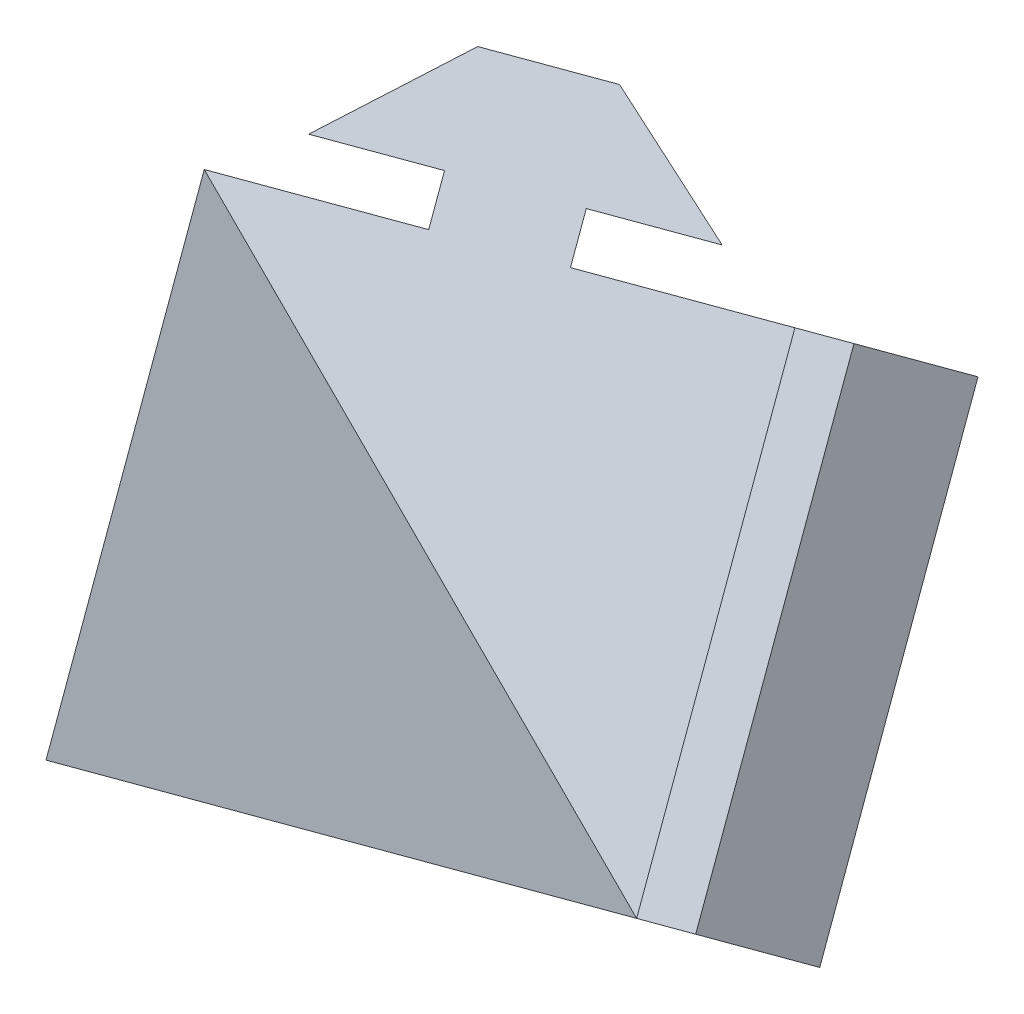
ISO-10303-21;
HEADER;
FILE_DESCRIPTION(('STEP AP214'),'2;1');
FILE_NAME('part.step','',(''),(''),'','','');
FILE_SCHEMA(('AUTOMOTIVE_DESIGN { 1 0 10303 214 1 1 1 1 }'));
ENDSEC;
DATA;
#1=APPLICATION_CONTEXT('core data for automotive mechanical design processes');
#2=APPLICATION_PROTOCOL_DEFINITION('international standard','automotive_design',2000,#1);
#3=PRODUCT_CONTEXT('',#1,'mechanical');
#4=PRODUCT('Part','Part','',(#3));
#5=PRODUCT_RELATED_PRODUCT_CATEGORY('part','',(#4));
#6=PRODUCT_DEFINITION_FORMATION('','',#4);
#7=PRODUCT_DEFINITION_CONTEXT('part definition',#1,'design');
#8=PRODUCT_DEFINITION('design','',#6,#7);
#9=PRODUCT_DEFINITION_SHAPE('','',#8);
#10=(LENGTH_UNIT() NAMED_UNIT(*) SI_UNIT(.MILLI.,.METRE.));
#11=(NAMED_UNIT(*) PLANE_ANGLE_UNIT() SI_UNIT($,.RADIAN.));
#12=(NAMED_UNIT(*) SI_UNIT($,.STERADIAN.) SOLID_ANGLE_UNIT());
#13=UNCERTAINTY_MEASURE_WITH_UNIT(LENGTH_MEASURE(1.E-05),#10,'distance_accuracy_value','');
#14=(GEOMETRIC_REPRESENTATION_CONTEXT(3) GLOBAL_UNCERTAINTY_ASSIGNED_CONTEXT((#13)) GLOBAL_UNIT_ASSIGNED_CONTEXT((#10,
#11,#12)) REPRESENTATION_CONTEXT('',''));
#15=CARTESIAN_POINT('',(0.,0.,0.));
#16=DIRECTION('',(0.,0.,1.));
#17=DIRECTION('',(1.,0.,0.));
#18=AXIS2_PLACEMENT_3D('',#15,#16,#17);
#19=CARTESIAN_POINT('',(-73.0037702005573,-51.8749967036636,0.));
#20=DIRECTION('',(0.211324865405187,-0.788675134594813,0.577350269189626));
#21=DIRECTION('',(0.577350269189626,0.577350269189626,0.577350269189626));
#22=AXIS2_PLACEMENT_3D('',#19,#20,#21);
#23=PLANE('',#22);
#24=DIRECTION('',(-0.577350269189626,-0.577350269189626,-0.577350269189626));
#25=VECTOR('',#24,1.);
#26=CARTESIAN_POINT('',(-73.0037702005573,-51.8749967036636,0.));
#27=LINE('',#26,#25);
#28=CARTESIAN_POINT('',(-73.0037702005573,-51.8749967036636,0.));
#29=VERTEX_POINT('',#28);
#30=CARTESIAN_POINT('',(-77.3916322463984,-56.2628587495048,-4.38786204584115));
#31=VERTEX_POINT('',#30);
#32=EDGE_CURVE('E235',#29,#31,#27,.T.);
#33=ORIENTED_EDGE('',*,*,#32,.F.);
#34=DIRECTION('',(-0.965925826289068,-0.258819045102521,0.));
#35=VECTOR('',#34,1.);
#36=CARTESIAN_POINT('',(-73.0037702005573,-51.8749967036636,0.));
#37=LINE('',#36,#35);
#38=CARTESIAN_POINT('',(-100.324278276246,-59.1955047793524,0.));
#39=VERTEX_POINT('',#38);
#40=EDGE_CURVE('E202',#29,#39,#37,.T.);
#41=ORIENTED_EDGE('',*,*,#40,.T.);
#42=DIRECTION('',(0.788675134594813,-0.211324865405187,-0.577350269189626));
#43=VECTOR('',#42,1.);
#44=CARTESIAN_POINT('',(-84.5507755843498,-63.4220020874561,-11.5470053837925));
#45=LINE('',#44,#43);
#46=CARTESIAN_POINT('',(-84.5507755843498,-63.4220020874561,-11.5470053837925));
#47=VERTEX_POINT('',#46);
#48=EDGE_CURVE('E277',#39,#47,#45,.T.);
#49=ORIENTED_EDGE('',*,*,#48,.T.);
#50=CARTESIAN_POINT('',(-80.1629135385086,-59.0341400416149,-7.15914333795129));
#51=VERTEX_POINT('',#50);
#52=EDGE_CURVE('E231',#51,#47,#27,.T.);
#53=ORIENTED_EDGE('',*,*,#52,.F.);
#54=DIRECTION('',(0.788675134594815,-0.21132486540518,-0.577350269189626));
#55=VECTOR('',#54,1.);
#56=CARTESIAN_POINT('',(-78.5855632693189,-59.4567897724253,-8.31384387633061));
#57=LINE('',#56,#55);
#58=CARTESIAN_POINT('',(-78.5855632693189,-59.4567897724253,-8.31384387633061));
#59=VERTEX_POINT('',#58);
#60=EDGE_CURVE('E38',#51,#59,#57,.T.);
#61=ORIENTED_EDGE('',*,*,#60,.T.);
#62=DIRECTION('',(-0.57735026918962,-0.577350269189631,-0.577350269189626));
#63=VECTOR('',#62,1.);
#64=CARTESIAN_POINT('',(-81.2413745075912,-62.1126010106976,-10.9696551146029));
#65=LINE('',#64,#63);
#66=CARTESIAN_POINT('',(-81.2413745075912,-62.1126010106976,-10.9696551146029));
#67=VERTEX_POINT('',#66);
#68=EDGE_CURVE('E332',#59,#67,#65,.T.);
#69=ORIENTED_EDGE('',*,*,#68,.T.);
#70=DIRECTION('',(0.958144280134718,0.283874916113397,0.0370751998880033));
#71=VECTOR('',#70,1.);
#72=CARTESIAN_POINT('',(-75.2731277040207,-60.344354207127,-10.738715006927));
#73=LINE('',#72,#71);
#74=CARTESIAN_POINT('',(-75.2731277040207,-60.344354207127,-10.738715006927));
#75=VERTEX_POINT('',#74);
#76=EDGE_CURVE('E468',#67,#75,#73,.T.);
#77=ORIENTED_EDGE('',*,*,#76,.T.);
#78=DIRECTION('',(0.57735026918962,0.577350269189631,0.577350269189626));
#79=VECTOR('',#78,1.);
#80=CARTESIAN_POINT('',(-72.5018464119105,-57.5730729150168,-7.96743371481683));
#81=LINE('',#80,#79);
#82=CARTESIAN_POINT('',(-72.5018464119105,-57.5730729150168,-7.96743371481683));
#83=VERTEX_POINT('',#82);
#84=EDGE_CURVE('E471',#75,#83,#81,.T.);
#85=ORIENTED_EDGE('',*,*,#84,.T.);
#86=DIRECTION('',(-0.105414682710652,0.568854681310686,0.815654397536071));
#87=VECTOR('',#86,1.);
#88=CARTESIAN_POINT('',(-72.5018464119105,-57.5730729150168,-7.96743371481683));
#89=LINE('',#88,#87);
#90=CARTESIAN_POINT('',(-73.1584707389365,-54.0296972420427,-2.88675134594813));
#91=VERTEX_POINT('',#90);
#92=EDGE_CURVE('E475',#83,#91,#89,.T.);
#93=ORIENTED_EDGE('',*,*,#92,.T.);
#94=DIRECTION('',(-0.57735026918962,-0.577350269189631,-0.577350269189626));
#95=VECTOR('',#94,1.);
#96=CARTESIAN_POINT('',(-73.1584707389365,-54.0296972420427,-2.88675134594813));
#97=LINE('',#96,#95);
#98=CARTESIAN_POINT('',(-75.8142819772087,-56.685508480315,-5.54256258422041));
#99=VERTEX_POINT('',#98);
#100=EDGE_CURVE('E478',#91,#99,#97,.T.);
#101=ORIENTED_EDGE('',*,*,#100,.T.);
#102=DIRECTION('',(-0.788675134594815,0.21132486540518,0.577350269189626));
#103=VECTOR('',#102,1.);
#104=CARTESIAN_POINT('',(-75.8142819772087,-56.685508480315,-5.54256258422041));
#105=LINE('',#104,#103);
#106=EDGE_CURVE('E315',#99,#31,#105,.T.);
#107=ORIENTED_EDGE('',*,*,#106,.T.);
#108=EDGE_LOOP('',(#33,#41,#49,#53,#61,#69,#77,#85,#93,#101,#107));
#109=FACE_BOUND('',#108,.T.);
#110=ADVANCED_FACE('F15',(#109),#23,.T.);
#111=CARTESIAN_POINT('',(-93.0037702005573,-31.8749967036636,0.));
#112=DIRECTION('',(-0.788675134594813,0.211324865405187,0.577350269189626));
#113=DIRECTION('',(0.211324865405187,-0.788675134594813,0.577350269189626));
#114=AXIS2_PLACEMENT_3D('',#111,#112,#113);
#115=PLANE('',#114);
#116=DIRECTION('',(0.211324865405187,-0.788675134594813,0.577350269189626));
#117=VECTOR('',#116,1.);
#118=CARTESIAN_POINT('',(-104.55077558435,-43.4220020874561,-11.5470053837925));
#119=LINE('',#118,#117);
#120=CARTESIAN_POINT('',(-101.930347253325,-53.2015737564319,-4.38786204584116));
#121=VERTEX_POINT('',#120);
#122=EDGE_CURVE('E215',#121,#39,#119,.T.);
#123=ORIENTED_EDGE('',*,*,#122,.T.);
#124=DIRECTION('',(0.258819045102521,0.965925826289068,0.));
#125=VECTOR('',#124,1.);
#126=CARTESIAN_POINT('',(-93.0037702005573,-31.8749967036636,0.));
#127=LINE('',#126,#125);
#128=CARTESIAN_POINT('',(-93.0037702005573,-31.8749967036636,0.));
#129=VERTEX_POINT('',#128);
#130=EDGE_CURVE('E200',#39,#129,#127,.T.);
#131=ORIENTED_EDGE('',*,*,#130,.T.);
#132=DIRECTION('',(-0.577350269189626,-0.577350269189626,-0.577350269189626));
#133=VECTOR('',#132,1.);
#134=CARTESIAN_POINT('',(-93.0037702005573,-31.8749967036636,0.));
#135=LINE('',#134,#133);
#136=CARTESIAN_POINT('',(-104.55077558435,-43.4220020874561,-11.5470053837925));
#137=VERTEX_POINT('',#136);
#138=EDGE_CURVE('E211',#129,#137,#135,.T.);
#139=ORIENTED_EDGE('',*,*,#138,.T.);
#140=CARTESIAN_POINT('',(-102.94470660727,-49.4159331103768,-7.15914333795133));
#141=VERTEX_POINT('',#140);
#142=EDGE_CURVE('E275',#137,#141,#119,.T.);
#143=ORIENTED_EDGE('',*,*,#142,.T.);
#144=DIRECTION('',(-0.577350269189623,-0.577350269189629,-0.577350269189626));
#145=VECTOR('',#144,1.);
#146=CARTESIAN_POINT('',(-104.09940714565,-50.570633648756,-8.31384387633061));
#147=LINE('',#146,#145);
#148=CARTESIAN_POINT('',(-104.09940714565,-50.570633648756,-8.31384387633061));
#149=VERTEX_POINT('',#148);
#150=EDGE_CURVE('E348',#141,#149,#147,.T.);
#151=ORIENTED_EDGE('',*,*,#150,.T.);
#152=DIRECTION('',(-0.211324865405191,0.788675134594812,-0.577350269189626));
#153=VECTOR('',#152,1.);
#154=CARTESIAN_POINT('',(-105.071501526514,-46.9427280296199,-10.9696551146029));
#155=LINE('',#154,#153);
#156=CARTESIAN_POINT('',(-105.071501526514,-46.9427280296199,-10.9696551146029));
#157=VERTEX_POINT('',#156);
#158=EDGE_CURVE('E351',#149,#157,#155,.T.);
#159=ORIENTED_EDGE('',*,*,#158,.T.);
#160=DIRECTION('',(-0.233229251215985,-0.971714745144117,0.0370751998880033));
#161=VECTOR('',#160,1.);
#162=CARTESIAN_POINT('',(-106.524278276246,-52.9955047793525,-10.738715006927));
#163=LINE('',#162,#161);
#164=CARTESIAN_POINT('',(-106.524278276246,-52.9955047793525,-10.738715006927));
#165=VERTEX_POINT('',#164);
#166=EDGE_CURVE('E333',#157,#165,#163,.T.);
#167=ORIENTED_EDGE('',*,*,#166,.T.);
#168=DIRECTION('',(0.211324865405191,-0.788675134594812,0.577350269189626));
#169=VECTOR('',#168,1.);
#170=CARTESIAN_POINT('',(-105.509918922301,-56.7811454254076,-7.96743371481684));
#171=LINE('',#170,#169);
#172=CARTESIAN_POINT('',(-105.509918922301,-56.7811454254076,-7.96743371481684));
#173=VERTEX_POINT('',#172);
#174=EDGE_CURVE('E336',#165,#173,#171,.T.);
#175=ORIENTED_EDGE('',*,*,#174,.T.);
#176=DIRECTION('',(0.545349946432079,-0.193135547496045,0.815654397536071));
#177=VECTOR('',#176,1.);
#178=CARTESIAN_POINT('',(-105.509918922301,-56.7811454254076,-7.96743371481684));
#179=LINE('',#178,#177);
#180=CARTESIAN_POINT('',(-102.112953410841,-57.9841799139473,-2.88675134594813));
#181=VERTEX_POINT('',#180);
#182=EDGE_CURVE('E340',#173,#181,#179,.T.);
#183=ORIENTED_EDGE('',*,*,#182,.T.);
#184=DIRECTION('',(-0.211324865405191,0.788675134594812,-0.577350269189626));
#185=VECTOR('',#184,1.);
#186=CARTESIAN_POINT('',(-102.112953410841,-57.9841799139473,-2.88675134594813));
#187=LINE('',#186,#185);
#188=CARTESIAN_POINT('',(-103.085047791705,-54.3562742948111,-5.54256258422041));
#189=VERTEX_POINT('',#188);
#190=EDGE_CURVE('E343',#181,#189,#187,.T.);
#191=ORIENTED_EDGE('',*,*,#190,.T.);
#192=DIRECTION('',(0.577350269189623,0.577350269189629,0.577350269189626));
#193=VECTOR('',#192,1.);
#194=CARTESIAN_POINT('',(-103.085047791705,-54.3562742948111,-5.54256258422041));
#195=LINE('',#194,#193);
#196=EDGE_CURVE('E346',#189,#121,#195,.T.);
#197=ORIENTED_EDGE('',*,*,#196,.T.);
#198=EDGE_LOOP('',(#123,#131,#139,#143,#151,#159,#167,#175,#183,#191,#197));
#199=FACE_BOUND('',#198,.T.);
#200=ADVANCED_FACE('F208',(#199),#115,.T.);
#201=CARTESIAN_POINT('',(-88.7772728924536,-47.6484993955599,11.5470053837925));
#202=DIRECTION('',(0.577350269189626,0.577350269189626,0.577350269189626));
#203=DIRECTION('',(-0.788675134594813,0.211324865405187,0.577350269189626));
#204=AXIS2_PLACEMENT_3D('',#201,#202,#203);
#205=PLANE('',#204);
#206=DIRECTION('',(-0.788675134594813,0.211324865405187,0.577350269189626));
#207=VECTOR('',#206,1.);
#208=CARTESIAN_POINT('',(-87.0098391776367,-33.481065680743,-4.38786204584116));
#209=LINE('',#208,#207);
#210=CARTESIAN_POINT('',(-87.0098391776367,-33.481065680743,-4.38786204584116));
#211=VERTEX_POINT('',#210);
#212=EDGE_CURVE('E219',#211,#129,#209,.T.);
#213=ORIENTED_EDGE('',*,*,#212,.T.);
#214=DIRECTION('',(0.707106781186548,-0.707106781186547,0.));
#215=VECTOR('',#214,1.);
#216=CARTESIAN_POINT('',(-83.0037702005573,-41.8749967036636,0.));
#217=LINE('',#216,#215);
#218=EDGE_CURVE('E10',#129,#29,#217,.T.);
#219=ORIENTED_EDGE('',*,*,#218,.T.);
#220=DIRECTION('',(-0.211324865405187,0.788675134594813,-0.577350269189626));
#221=VECTOR('',#220,1.);
#222=CARTESIAN_POINT('',(-77.230267508661,-36.1014940117674,-11.5470053837925));
#223=LINE('',#222,#221);
#224=CARTESIAN_POINT('',(-77.230267508661,-36.1014940117674,-11.5470053837925));
#225=VERTEX_POINT('',#224);
#226=EDGE_CURVE('E225',#29,#225,#223,.T.);
#227=ORIENTED_EDGE('',*,*,#226,.T.);
#228=DIRECTION('',(-0.788675134594813,0.211324865405187,0.577350269189626));
#229=VECTOR('',#228,1.);
#230=CARTESIAN_POINT('',(-83.2241985315816,-34.4954250346879,-7.15914333795136));
#231=LINE('',#230,#229);
#232=CARTESIAN_POINT('',(-83.2241985315816,-34.4954250346879,-7.15914333795136));
#233=VERTEX_POINT('',#232);
#234=EDGE_CURVE('E256',#225,#233,#231,.T.);
#235=ORIENTED_EDGE('',*,*,#234,.T.);
#236=DIRECTION('',(-0.211324865405187,0.788675134594813,-0.577350269189626));
#237=VECTOR('',#236,1.);
#238=CARTESIAN_POINT('',(-83.646848262392,-32.9180747654983,-8.31384387633061));
#239=LINE('',#238,#237);
#240=CARTESIAN_POINT('',(-83.646848262392,-32.9180747654983,-8.31384387633061));
#241=VERTEX_POINT('',#240);
#242=EDGE_CURVE('E251',#233,#241,#239,.T.);
#243=ORIENTED_EDGE('',*,*,#242,.T.);
#244=DIRECTION('',(0.788675134594813,-0.211324865405187,-0.577350269189626));
#245=VECTOR('',#244,1.);
#246=CARTESIAN_POINT('',(-80.0189426432558,-33.8901691463622,-10.9696551146029));
#247=LINE('',#246,#245);
#248=CARTESIAN_POINT('',(-80.0189426432558,-33.8901691463622,-10.9696551146029));
#249=VERTEX_POINT('',#248);
#250=EDGE_CURVE('E246',#241,#249,#247,.T.);
#251=ORIENTED_EDGE('',*,*,#250,.T.);
#252=DIRECTION('',(-0.724915028918731,0.687839829030727,0.0370751998880031));
#253=VECTOR('',#252,1.);
#254=CARTESIAN_POINT('',(-84.5344126970938,-29.6056392002001,-10.738715006927));
#255=LINE('',#254,#253);
#256=CARTESIAN_POINT('',(-84.5344126970938,-29.6056392002001,-10.738715006927));
#257=VERTEX_POINT('',#256);
#258=EDGE_CURVE('E292',#249,#257,#255,.T.);
#259=ORIENTED_EDGE('',*,*,#258,.T.);
#260=DIRECTION('',(-0.788675134594813,0.211324865405187,0.577350269189626));
#261=VECTOR('',#260,1.);
#262=CARTESIAN_POINT('',(-88.3200533431489,-28.5912798462552,-7.96743371481684));
#263=LINE('',#262,#261);
#264=CARTESIAN_POINT('',(-88.3200533431489,-28.5912798462552,-7.96743371481684));
#265=VERTEX_POINT('',#264);
#266=EDGE_CURVE('E391',#257,#265,#263,.T.);
#267=ORIENTED_EDGE('',*,*,#266,.T.);
#268=DIRECTION('',(-0.439935263721432,-0.375719133814639,0.815654397536071));
#269=VECTOR('',#268,1.);
#270=CARTESIAN_POINT('',(-88.3200533431489,-28.5912798462552,-7.96743371481684));
#271=LINE('',#270,#269);
#272=CARTESIAN_POINT('',(-91.0603945275832,-30.9316210306896,-2.88675134594813));
#273=VERTEX_POINT('',#272);
#274=EDGE_CURVE('E393',#265,#273,#271,.T.);
#275=ORIENTED_EDGE('',*,*,#274,.T.);
#276=DIRECTION('',(0.788675134594813,-0.211324865405187,-0.577350269189626));
#277=VECTOR('',#276,1.);
#278=CARTESIAN_POINT('',(-91.0603945275832,-30.9316210306896,-2.88675134594813));
#279=LINE('',#278,#277);
#280=CARTESIAN_POINT('',(-87.4324889084471,-31.9037154115534,-5.54256258422041));
#281=VERTEX_POINT('',#280);
#282=EDGE_CURVE('E395',#273,#281,#279,.T.);
#283=ORIENTED_EDGE('',*,*,#282,.T.);
#284=DIRECTION('',(0.211324865405187,-0.788675134594813,0.577350269189626));
#285=VECTOR('',#284,1.);
#286=CARTESIAN_POINT('',(-87.4324889084471,-31.9037154115534,-5.54256258422041));
#287=LINE('',#286,#285);
#288=EDGE_CURVE('E222',#281,#211,#287,.T.);
#289=ORIENTED_EDGE('',*,*,#288,.T.);
#290=EDGE_LOOP('',(#213,#219,#227,#235,#243,#251,#259,#267,#275,#283,#289));
#291=FACE_BOUND('',#290,.T.);
#292=ADVANCED_FACE('F220',(#291),#205,.T.);
#293=CARTESIAN_POINT('',(-77.230267508661,-36.1014940117674,-11.5470053837925));
#294=DIRECTION('',(0.788675134594813,-0.211324865405187,-0.577350269189626));
#295=DIRECTION('',(-0.211324865405187,0.788675134594813,-0.577350269189626));
#296=AXIS2_PLACEMENT_3D('',#293,#294,#295);
#297=PLANE('',#296);
#298=DIRECTION('',(-0.211324865405194,0.788675134594811,-0.577350269189626));
#299=VECTOR('',#298,1.);
#300=CARTESIAN_POINT('',(-80.1629135385085,-59.0341400416149,-7.15914333795136));
#301=LINE('',#300,#299);
#302=CARTESIAN_POINT('',(-84.3894108466124,-43.2606373497187,-18.7061487217438));
#303=VERTEX_POINT('',#302);
#304=EDGE_CURVE('E318',#51,#303,#301,.T.);
#305=ORIENTED_EDGE('',*,*,#304,.F.);
#306=ORIENTED_EDGE('',*,*,#52,.T.);
#307=DIRECTION('',(-0.211324865405187,0.788675134594813,-0.577350269189626));
#308=VECTOR('',#307,1.);
#309=CARTESIAN_POINT('',(-88.7772728924536,-47.6484993955599,-23.094010767585));
#310=LINE('',#309,#308);
#311=CARTESIAN_POINT('',(-86.1568445614292,-57.4280710645356,-15.9348674296337));
#312=VERTEX_POINT('',#311);
#313=EDGE_CURVE('E280',#47,#312,#310,.T.);
#314=ORIENTED_EDGE('',*,*,#313,.T.);
#315=DIRECTION('',(0.577350269189623,0.577350269189629,0.577350269189626));
#316=VECTOR('',#315,1.);
#317=CARTESIAN_POINT('',(-87.3115450998084,-58.5827716029148,-17.0895679680129));
#318=LINE('',#317,#316);
#319=CARTESIAN_POINT('',(-87.3115450998084,-58.5827716029148,-17.0895679680129));
#320=VERTEX_POINT('',#319);
#321=EDGE_CURVE('E368',#320,#312,#318,.T.);
#322=ORIENTED_EDGE('',*,*,#321,.F.);
#323=DIRECTION('',(-0.211324865405191,0.788675134594812,-0.577350269189626));
#324=VECTOR('',#323,1.);
#325=CARTESIAN_POINT('',(-86.3394507189445,-62.2106772220509,-14.4337567297406));
#326=LINE('',#325,#324);
#327=CARTESIAN_POINT('',(-86.3394507189445,-62.2106772220509,-14.4337567297406));
#328=VERTEX_POINT('',#327);
#329=EDGE_CURVE('E365',#328,#320,#326,.T.);
#330=ORIENTED_EDGE('',*,*,#329,.F.);
#331=DIRECTION('',(0.545349946432079,-0.193135547496045,0.815654397536071));
#332=VECTOR('',#331,1.);
#333=CARTESIAN_POINT('',(-89.7364162304048,-61.0076427335112,-19.5144390986094));
#334=LINE('',#333,#332);
#335=CARTESIAN_POINT('',(-89.7364162304048,-61.0076427335112,-19.5144390986094));
#336=VERTEX_POINT('',#335);
#337=EDGE_CURVE('E362',#336,#328,#334,.T.);
#338=ORIENTED_EDGE('',*,*,#337,.F.);
#339=DIRECTION('',(0.211324865405191,-0.788675134594812,0.577350269189626));
#340=VECTOR('',#339,1.);
#341=CARTESIAN_POINT('',(-89.7364162304048,-61.0076427335112,-19.5144390986094));
#342=LINE('',#341,#340);
#343=CARTESIAN_POINT('',(-90.7507755843498,-57.2220020874561,-22.2857203907196));
#344=VERTEX_POINT('',#343);
#345=EDGE_CURVE('E358',#344,#336,#342,.T.);
#346=ORIENTED_EDGE('',*,*,#345,.F.);
#347=DIRECTION('',(-0.233229251215985,-0.971714745144117,0.0370751998880033));
#348=VECTOR('',#347,1.);
#349=CARTESIAN_POINT('',(-90.7507755843498,-57.2220020874561,-22.2857203907196));
#350=LINE('',#349,#348);
#351=CARTESIAN_POINT('',(-89.2979988346172,-51.1692253377236,-22.5166604983954));
#352=VERTEX_POINT('',#351);
#353=EDGE_CURVE('E355',#352,#344,#350,.T.);
#354=ORIENTED_EDGE('',*,*,#353,.F.);
#355=DIRECTION('',(-0.211324865405191,0.788675134594812,-0.577350269189626));
#356=VECTOR('',#355,1.);
#357=CARTESIAN_POINT('',(-89.2979988346172,-51.1692253377236,-22.5166604983954));
#358=LINE('',#357,#356);
#359=CARTESIAN_POINT('',(-88.3259044537533,-54.7971309568597,-19.8608492601231));
#360=VERTEX_POINT('',#359);
#361=EDGE_CURVE('E337',#360,#352,#358,.T.);
#362=ORIENTED_EDGE('',*,*,#361,.F.);
#363=DIRECTION('',(-0.577350269189623,-0.577350269189629,-0.577350269189626));
#364=VECTOR('',#363,1.);
#365=CARTESIAN_POINT('',(-88.3259044537533,-54.7971309568597,-19.8608492601231));
#366=LINE('',#365,#364);
#367=CARTESIAN_POINT('',(-87.1712039153741,-53.6424304184805,-18.7061487217439));
#368=VERTEX_POINT('',#367);
#369=EDGE_CURVE('E371',#368,#360,#366,.T.);
#370=ORIENTED_EDGE('',*,*,#369,.F.);
#371=CARTESIAN_POINT('',(-88.7772728924536,-47.6484993955599,-23.094010767585));
#372=VERTEX_POINT('',#371);
#373=EDGE_CURVE('E279',#368,#372,#310,.T.);
#374=ORIENTED_EDGE('',*,*,#373,.T.);
#375=DIRECTION('',(-0.577350269189626,-0.577350269189626,-0.577350269189626));
#376=VECTOR('',#375,1.);
#377=CARTESIAN_POINT('',(-77.230267508661,-36.1014940117674,-11.5470053837925));
#378=LINE('',#377,#376);
#379=EDGE_CURVE('E299',#303,#372,#378,.T.);
#380=ORIENTED_EDGE('',*,*,#379,.F.);
#381=EDGE_LOOP('',(#305,#306,#314,#322,#330,#338,#346,#354,#362,#370,#374,#380));
#382=FACE_BOUND('',#381,.T.);
#383=ADVANCED_FACE('F553',(#382),#297,.T.);
#384=CARTESIAN_POINT('',(-100.324278276246,-59.1955047793524,0.));
#385=DIRECTION('',(0.577350269189626,0.577350269189626,0.577350269189626));
#386=DIRECTION('',(-0.788675134594813,0.211324865405187,0.577350269189626));
#387=AXIS2_PLACEMENT_3D('',#384,#385,#386);
#388=PLANE('',#387);
#389=DIRECTION('',(0.211324865405187,-0.788675134594813,0.577350269189626));
#390=VECTOR('',#389,1.);
#391=CARTESIAN_POINT('',(-98.9794942922396,-43.4507207953459,-17.0895679680129));
#392=LINE('',#391,#390);
#393=CARTESIAN_POINT('',(-98.9794942922396,-43.4507207953459,-17.0895679680129));
#394=VERTEX_POINT('',#393);
#395=CARTESIAN_POINT('',(-98.5568445614292,-45.0280710645356,-15.9348674296337));
#396=VERTEX_POINT('',#395);
#397=EDGE_CURVE('E271',#394,#396,#392,.T.);
#398=ORIENTED_EDGE('',*,*,#397,.F.);
#399=DIRECTION('',(0.788675134594813,-0.211324865405187,-0.577350269189626));
#400=VECTOR('',#399,1.);
#401=CARTESIAN_POINT('',(-102.607399911376,-42.4786264144821,-14.4337567297406));
#402=LINE('',#401,#400);
#403=CARTESIAN_POINT('',(-102.607399911376,-42.4786264144821,-14.4337567297406));
#404=VERTEX_POINT('',#403);
#405=EDGE_CURVE('E268',#404,#394,#402,.T.);
#406=ORIENTED_EDGE('',*,*,#405,.F.);
#407=DIRECTION('',(-0.439935263721432,-0.375719133814639,0.815654397536071));
#408=VECTOR('',#407,1.);
#409=CARTESIAN_POINT('',(-99.8670587269414,-40.1382852300477,-19.5144390986094));
#410=LINE('',#409,#408);
#411=CARTESIAN_POINT('',(-99.8670587269414,-40.1382852300477,-19.5144390986094));
#412=VERTEX_POINT('',#411);
#413=EDGE_CURVE('E265',#412,#404,#410,.T.);
#414=ORIENTED_EDGE('',*,*,#413,.F.);
#415=DIRECTION('',(-0.788675134594813,0.211324865405187,0.577350269189626));
#416=VECTOR('',#415,1.);
#417=CARTESIAN_POINT('',(-99.8670587269414,-40.1382852300477,-19.5144390986094));
#418=LINE('',#417,#416);
#419=CARTESIAN_POINT('',(-96.0814180808863,-41.1526445839926,-22.2857203907196));
#420=VERTEX_POINT('',#419);
#421=EDGE_CURVE('E262',#420,#412,#418,.T.);
#422=ORIENTED_EDGE('',*,*,#421,.F.);
#423=DIRECTION('',(-0.724915028918731,0.687839829030727,0.0370751998880031));
#424=VECTOR('',#423,1.);
#425=CARTESIAN_POINT('',(-96.0814180808863,-41.1526445839926,-22.2857203907196));
#426=LINE('',#425,#424);
#427=CARTESIAN_POINT('',(-91.5659480270484,-45.4371745301547,-22.5166604983954));
#428=VERTEX_POINT('',#427);
#429=EDGE_CURVE('E260',#428,#420,#426,.T.);
#430=ORIENTED_EDGE('',*,*,#429,.F.);
#431=DIRECTION('',(0.788675134594813,-0.211324865405187,-0.577350269189626));
#432=VECTOR('',#431,1.);
#433=CARTESIAN_POINT('',(-91.5659480270484,-45.4371745301547,-22.5166604983954));
#434=LINE('',#433,#432);
#435=CARTESIAN_POINT('',(-95.1938536461845,-44.4650801492908,-19.8608492601231));
#436=VERTEX_POINT('',#435);
#437=EDGE_CURVE('E289',#436,#428,#434,.T.);
#438=ORIENTED_EDGE('',*,*,#437,.F.);
#439=DIRECTION('',(-0.211324865405187,0.788675134594813,-0.577350269189626));
#440=VECTOR('',#439,1.);
#441=CARTESIAN_POINT('',(-95.1938536461845,-44.4650801492908,-19.8608492601231));
#442=LINE('',#441,#440);
#443=CARTESIAN_POINT('',(-94.7712039153741,-46.0424304184805,-18.7061487217439));
#444=VERTEX_POINT('',#443);
#445=EDGE_CURVE('E286',#444,#436,#442,.T.);
#446=ORIENTED_EDGE('',*,*,#445,.F.);
#447=DIRECTION('',(-0.788675134594813,0.211324865405187,0.577350269189626));
#448=VECTOR('',#447,1.);
#449=CARTESIAN_POINT('',(-94.7712039153741,-46.0424304184805,-18.7061487217439));
#450=LINE('',#449,#448);
#451=EDGE_CURVE('E283',#372,#444,#450,.T.);
#452=ORIENTED_EDGE('',*,*,#451,.F.);
#453=ORIENTED_EDGE('',*,*,#373,.F.);
#454=DIRECTION('',(0.788675134594814,-0.211324865405184,-0.577350269189626));
#455=VECTOR('',#454,1.);
#456=CARTESIAN_POINT('',(-102.94470660727,-49.4159331103768,-7.15914333795136));
#457=LINE('',#456,#455);
#458=EDGE_CURVE('E379',#141,#368,#457,.T.);
#459=ORIENTED_EDGE('',*,*,#458,.F.);
#460=ORIENTED_EDGE('',*,*,#142,.F.);
#461=DIRECTION('',(-0.788675134594813,0.211324865405187,0.577350269189626));
#462=VECTOR('',#461,1.);
#463=CARTESIAN_POINT('',(-98.5568445614292,-45.0280710645356,-15.9348674296337));
#464=LINE('',#463,#462);
#465=EDGE_CURVE('E229',#396,#137,#464,.T.);
#466=ORIENTED_EDGE('',*,*,#465,.F.);
#467=EDGE_LOOP('',(#398,#406,#414,#422,#430,#438,#446,#452,#453,#459,#460,#466));
#468=FACE_BOUND('',#467,.T.);
#469=ADVANCED_FACE('F428',(#468),#388,.F.);
#470=CARTESIAN_POINT('',(-84.5344126970938,-29.6056392002001,-10.738715006927));
#471=DIRECTION('',(0.375719133814639,0.439935263721432,-0.815654397536071));
#472=DIRECTION('',(-0.724915028918731,0.687839829030727,0.0370751998880031));
#473=AXIS2_PLACEMENT_3D('',#470,#471,#472);
#474=PLANE('',#473);
#475=ORIENTED_EDGE('',*,*,#429,.T.);
#476=DIRECTION('',(-0.577350269189626,-0.577350269189626,-0.577350269189626));
#477=VECTOR('',#476,1.);
#478=CARTESIAN_POINT('',(-84.5344126970938,-29.6056392002001,-10.738715006927));
#479=LINE('',#478,#477);
#480=EDGE_CURVE('E245',#257,#420,#479,.T.);
#481=ORIENTED_EDGE('',*,*,#480,.F.);
#482=ORIENTED_EDGE('',*,*,#258,.F.);
#483=DIRECTION('',(-0.577350269189626,-0.577350269189626,-0.577350269189626));
#484=VECTOR('',#483,1.);
#485=CARTESIAN_POINT('',(-80.0189426432558,-33.8901691463622,-10.9696551146029));
#486=LINE('',#485,#484);
#487=EDGE_CURVE('E23',#249,#428,#486,.T.);
#488=ORIENTED_EDGE('',*,*,#487,.T.);
#489=EDGE_LOOP('',(#475,#481,#482,#488));
#490=FACE_BOUND('',#489,.T.);
#491=ADVANCED_FACE('F17',(#490),#474,.T.);
#492=CARTESIAN_POINT('',(-80.0189426432558,-33.8901691463622,-10.9696551146029));
#493=DIRECTION('',(0.211324865405187,-0.788675134594813,0.577350269189626));
#494=DIRECTION('',(0.577350269189626,0.577350269189626,0.577350269189626));
#495=AXIS2_PLACEMENT_3D('',#492,#493,#494);
#496=PLANE('',#495);
#497=ORIENTED_EDGE('',*,*,#437,.T.);
#498=ORIENTED_EDGE('',*,*,#487,.F.);
#499=ORIENTED_EDGE('',*,*,#250,.F.);
#500=DIRECTION('',(-0.577350269189626,-0.577350269189626,-0.577350269189626));
#501=VECTOR('',#500,1.);
#502=CARTESIAN_POINT('',(-83.646848262392,-32.9180747654983,-8.31384387633061));
#503=LINE('',#502,#501);
#504=EDGE_CURVE('E294',#241,#436,#503,.T.);
#505=ORIENTED_EDGE('',*,*,#504,.T.);
#506=EDGE_LOOP('',(#497,#498,#499,#505));
#507=FACE_BOUND('',#506,.T.);
#508=ADVANCED_FACE('F407',(#507),#496,.T.);
#509=CARTESIAN_POINT('',(-83.646848262392,-32.9180747654983,-8.31384387633061));
#510=DIRECTION('',(0.788675134594813,-0.211324865405187,-0.577350269189626));
#511=DIRECTION('',(0.577350269189626,0.577350269189626,0.577350269189626));
#512=AXIS2_PLACEMENT_3D('',#509,#510,#511);
#513=PLANE('',#512);
#514=ORIENTED_EDGE('',*,*,#445,.T.);
#515=ORIENTED_EDGE('',*,*,#504,.F.);
#516=ORIENTED_EDGE('',*,*,#242,.F.);
#517=DIRECTION('',(-0.577350269189626,-0.577350269189626,-0.577350269189626));
#518=VECTOR('',#517,1.);
#519=CARTESIAN_POINT('',(-83.2241985315816,-34.4954250346879,-7.15914333795136));
#520=LINE('',#519,#518);
#521=EDGE_CURVE('E296',#233,#444,#520,.T.);
#522=ORIENTED_EDGE('',*,*,#521,.T.);
#523=EDGE_LOOP('',(#514,#515,#516,#522));
#524=FACE_BOUND('',#523,.T.);
#525=ADVANCED_FACE('F404',(#524),#513,.T.);
#526=CARTESIAN_POINT('',(-83.2241985315816,-34.4954250346879,-7.15914333795136));
#527=DIRECTION('',(-0.211324865405187,0.788675134594813,-0.577350269189626));
#528=DIRECTION('',(-0.577350269189626,-0.577350269189626,-0.577350269189626));
#529=AXIS2_PLACEMENT_3D('',#526,#527,#528);
#530=PLANE('',#529);
#531=ORIENTED_EDGE('',*,*,#451,.T.);
#532=ORIENTED_EDGE('',*,*,#521,.F.);
#533=ORIENTED_EDGE('',*,*,#234,.F.);
#534=CARTESIAN_POINT('',(-81.6181295545022,-40.4893560576085,-15.9348674296337));
#535=VERTEX_POINT('',#534);
#536=EDGE_CURVE('E297',#225,#535,#378,.T.);
#537=ORIENTED_EDGE('',*,*,#536,.T.);
#538=DIRECTION('',(-0.788675134594815,0.21132486540518,0.577350269189626));
#539=VECTOR('',#538,1.);
#540=CARTESIAN_POINT('',(-80.0407792853126,-40.9120057884188,-17.0895679680129));
#541=LINE('',#540,#539);
#542=CARTESIAN_POINT('',(-80.0407792853126,-40.9120057884188,-17.0895679680129));
#543=VERTEX_POINT('',#542);
#544=EDGE_CURVE('E317',#543,#535,#541,.T.);
#545=ORIENTED_EDGE('',*,*,#544,.F.);
#546=DIRECTION('',(-0.57735026918962,-0.577350269189631,-0.577350269189626));
#547=VECTOR('',#546,1.);
#548=CARTESIAN_POINT('',(-77.3849680470404,-38.2561945501465,-14.4337567297406));
#549=LINE('',#548,#547);
#550=CARTESIAN_POINT('',(-77.3849680470404,-38.2561945501465,-14.4337567297406));
#551=VERTEX_POINT('',#550);
#552=EDGE_CURVE('E489',#551,#543,#549,.T.);
#553=ORIENTED_EDGE('',*,*,#552,.F.);
#554=DIRECTION('',(-0.105414682710652,0.568854681310686,0.815654397536071));
#555=VECTOR('',#554,1.);
#556=CARTESIAN_POINT('',(-76.7283437200144,-41.7995702231206,-19.5144390986094));
#557=LINE('',#556,#555);
#558=CARTESIAN_POINT('',(-76.7283437200144,-41.7995702231206,-19.5144390986094));
#559=VERTEX_POINT('',#558);
#560=EDGE_CURVE('E486',#559,#551,#557,.T.);
#561=ORIENTED_EDGE('',*,*,#560,.F.);
#562=DIRECTION('',(0.57735026918962,0.577350269189631,0.577350269189626));
#563=VECTOR('',#562,1.);
#564=CARTESIAN_POINT('',(-76.7283437200144,-41.7995702231206,-19.5144390986094));
#565=LINE('',#564,#563);
#566=CARTESIAN_POINT('',(-79.4996250121246,-44.5708515152308,-22.2857203907196));
#567=VERTEX_POINT('',#566);
#568=EDGE_CURVE('E465',#567,#559,#565,.T.);
#569=ORIENTED_EDGE('',*,*,#568,.F.);
#570=DIRECTION('',(0.958144280134718,0.283874916113397,0.0370751998880033));
#571=VECTOR('',#570,1.);
#572=CARTESIAN_POINT('',(-79.4996250121246,-44.5708515152308,-22.2857203907196));
#573=LINE('',#572,#571);
#574=CARTESIAN_POINT('',(-85.467871815695,-46.3390983188013,-22.5166604983954));
#575=VERTEX_POINT('',#574);
#576=EDGE_CURVE('E462',#575,#567,#573,.T.);
#577=ORIENTED_EDGE('',*,*,#576,.F.);
#578=DIRECTION('',(-0.57735026918962,-0.577350269189631,-0.577350269189626));
#579=VECTOR('',#578,1.);
#580=CARTESIAN_POINT('',(-85.467871815695,-46.3390983188013,-22.5166604983954));
#581=LINE('',#580,#579);
#582=CARTESIAN_POINT('',(-82.8120605774228,-43.683287080529,-19.8608492601231));
#583=VERTEX_POINT('',#582);
#584=EDGE_CURVE('E472',#583,#575,#581,.T.);
#585=ORIENTED_EDGE('',*,*,#584,.F.);
#586=DIRECTION('',(0.788675134594815,-0.21132486540518,-0.577350269189626));
#587=VECTOR('',#586,1.);
#588=CARTESIAN_POINT('',(-82.8120605774228,-43.683287080529,-19.8608492601231));
#589=LINE('',#588,#587);
#590=EDGE_CURVE('E30',#303,#583,#589,.T.);
#591=ORIENTED_EDGE('',*,*,#590,.F.);
#592=ORIENTED_EDGE('',*,*,#379,.T.);
#593=EDGE_LOOP('',(#531,#532,#533,#537,#545,#553,#561,#569,#577,#585,#591,#592));
#594=FACE_BOUND('',#593,.T.);
#595=ADVANCED_FACE('F401',(#594),#530,.T.);
#596=DIRECTION('',(-0.211324865405194,0.788675134594811,-0.577350269189626));
#597=VECTOR('',#596,1.);
#598=CARTESIAN_POINT('',(-77.3916322463984,-56.2628587495047,-4.38786204584115));
#599=LINE('',#598,#597);
#600=EDGE_CURVE('E309',#31,#535,#599,.T.);
#601=ORIENTED_EDGE('',*,*,#600,.T.);
#602=ORIENTED_EDGE('',*,*,#536,.F.);
#603=ORIENTED_EDGE('',*,*,#226,.F.);
#604=ORIENTED_EDGE('',*,*,#32,.T.);
#605=EDGE_LOOP('',(#601,#602,#603,#604));
#606=FACE_BOUND('',#605,.T.);
#607=ADVANCED_FACE('F308',(#606),#297,.T.);
#608=CARTESIAN_POINT('',(-87.0098391776367,-33.481065680743,-4.38786204584116));
#609=DIRECTION('',(-0.211324865405187,0.788675134594813,-0.577350269189626));
#610=DIRECTION('',(-0.577350269189626,-0.577350269189626,-0.577350269189626));
#611=AXIS2_PLACEMENT_3D('',#608,#609,#610);
#612=PLANE('',#611);
#613=ORIENTED_EDGE('',*,*,#465,.T.);
#614=ORIENTED_EDGE('',*,*,#138,.F.);
#615=ORIENTED_EDGE('',*,*,#212,.F.);
#616=DIRECTION('',(-0.577350269189626,-0.577350269189626,-0.577350269189626));
#617=VECTOR('',#616,1.);
#618=CARTESIAN_POINT('',(-87.0098391776367,-33.481065680743,-4.38786204584116));
#619=LINE('',#618,#617);
#620=EDGE_CURVE('E232',#211,#396,#619,.T.);
#621=ORIENTED_EDGE('',*,*,#620,.T.);
#622=EDGE_LOOP('',(#613,#614,#615,#621));
#623=FACE_BOUND('',#622,.T.);
#624=ADVANCED_FACE('F227',(#623),#612,.T.);
#625=CARTESIAN_POINT('',(-87.4324889084471,-31.9037154115534,-5.54256258422041));
#626=DIRECTION('',(-0.788675134594813,0.211324865405187,0.577350269189626));
#627=DIRECTION('',(-0.577350269189626,-0.577350269189626,-0.577350269189626));
#628=AXIS2_PLACEMENT_3D('',#625,#626,#627);
#629=PLANE('',#628);
#630=ORIENTED_EDGE('',*,*,#397,.T.);
#631=ORIENTED_EDGE('',*,*,#620,.F.);
#632=ORIENTED_EDGE('',*,*,#288,.F.);
#633=DIRECTION('',(-0.577350269189626,-0.577350269189626,-0.577350269189626));
#634=VECTOR('',#633,1.);
#635=CARTESIAN_POINT('',(-87.4324889084471,-31.9037154115534,-5.54256258422041));
#636=LINE('',#635,#634);
#637=EDGE_CURVE('E237',#281,#394,#636,.T.);
#638=ORIENTED_EDGE('',*,*,#637,.T.);
#639=EDGE_LOOP('',(#630,#631,#632,#638));
#640=FACE_BOUND('',#639,.T.);
#641=ADVANCED_FACE('F426',(#640),#629,.T.);
#642=CARTESIAN_POINT('',(-91.0603945275832,-30.9316210306896,-2.88675134594813));
#643=DIRECTION('',(0.211324865405187,-0.788675134594813,0.577350269189626));
#644=DIRECTION('',(0.577350269189626,0.577350269189626,0.577350269189626));
#645=AXIS2_PLACEMENT_3D('',#642,#643,#644);
#646=PLANE('',#645);
#647=ORIENTED_EDGE('',*,*,#405,.T.);
#648=ORIENTED_EDGE('',*,*,#637,.F.);
#649=ORIENTED_EDGE('',*,*,#282,.F.);
#650=DIRECTION('',(-0.577350269189626,-0.577350269189626,-0.577350269189626));
#651=VECTOR('',#650,1.);
#652=CARTESIAN_POINT('',(-91.0603945275832,-30.9316210306896,-2.88675134594813));
#653=LINE('',#652,#651);
#654=EDGE_CURVE('E242',#273,#404,#653,.T.);
#655=ORIENTED_EDGE('',*,*,#654,.T.);
#656=EDGE_LOOP('',(#647,#648,#649,#655));
#657=FACE_BOUND('',#656,.T.);
#658=ADVANCED_FACE('F423',(#657),#646,.T.);
#659=CARTESIAN_POINT('',(-88.3200533431489,-28.5912798462552,-7.96743371481684));
#660=DIRECTION('',(-0.687839829030728,0.724915028918731,-0.0370751998880032));
#661=DIRECTION('',(-0.439935263721432,-0.375719133814639,0.815654397536071));
#662=AXIS2_PLACEMENT_3D('',#659,#660,#661);
#663=PLANE('',#662);
#664=ORIENTED_EDGE('',*,*,#413,.T.);
#665=ORIENTED_EDGE('',*,*,#654,.F.);
#666=ORIENTED_EDGE('',*,*,#274,.F.);
#667=DIRECTION('',(-0.577350269189626,-0.577350269189626,-0.577350269189626));
#668=VECTOR('',#667,1.);
#669=CARTESIAN_POINT('',(-88.3200533431489,-28.5912798462552,-7.96743371481684));
#670=LINE('',#669,#668);
#671=EDGE_CURVE('E244',#265,#412,#670,.T.);
#672=ORIENTED_EDGE('',*,*,#671,.T.);
#673=EDGE_LOOP('',(#664,#665,#666,#672));
#674=FACE_BOUND('',#673,.T.);
#675=ADVANCED_FACE('F418',(#674),#663,.T.);
#676=CARTESIAN_POINT('',(-88.3200533431489,-28.5912798462552,-7.96743371481684));
#677=DIRECTION('',(-0.211324865405187,0.788675134594813,-0.577350269189626));
#678=DIRECTION('',(-0.577350269189626,-0.577350269189626,-0.577350269189626));
#679=AXIS2_PLACEMENT_3D('',#676,#677,#678);
#680=PLANE('',#679);
#681=ORIENTED_EDGE('',*,*,#421,.T.);
#682=ORIENTED_EDGE('',*,*,#671,.F.);
#683=ORIENTED_EDGE('',*,*,#266,.F.);
#684=ORIENTED_EDGE('',*,*,#480,.T.);
#685=EDGE_LOOP('',(#681,#682,#683,#684));
#686=FACE_BOUND('',#685,.T.);
#687=ADVANCED_FACE('F414',(#686),#680,.T.);
#688=ORIENTED_EDGE('',*,*,#313,.F.);
#689=ORIENTED_EDGE('',*,*,#48,.F.);
#690=ORIENTED_EDGE('',*,*,#122,.F.);
#691=DIRECTION('',(0.788675134594814,-0.211324865405184,-0.577350269189626));
#692=VECTOR('',#691,1.);
#693=CARTESIAN_POINT('',(-101.930347253325,-53.2015737564319,-4.38786204584116));
#694=LINE('',#693,#692);
#695=EDGE_CURVE('E381',#121,#312,#694,.T.);
#696=ORIENTED_EDGE('',*,*,#695,.T.);
#697=EDGE_LOOP('',(#688,#689,#690,#696));
#698=FACE_BOUND('',#697,.T.);
#699=ADVANCED_FACE('F460',(#698),#388,.F.);
#700=CARTESIAN_POINT('',(-105.071501526514,-46.9427280296199,-10.9696551146029));
#701=DIRECTION('',(0.577350269189623,0.577350269189629,0.577350269189626));
#702=DIRECTION('',(-0.211324865405189,0.788675134594811,-0.577350269189628));
#703=AXIS2_PLACEMENT_3D('',#700,#701,#702);
#704=PLANE('',#703);
#705=ORIENTED_EDGE('',*,*,#361,.T.);
#706=DIRECTION('',(0.788675134594814,-0.211324865405184,-0.577350269189626));
#707=VECTOR('',#706,1.);
#708=CARTESIAN_POINT('',(-105.071501526514,-46.9427280296199,-10.9696551146029));
#709=LINE('',#708,#707);
#710=EDGE_CURVE('E263',#157,#352,#709,.T.);
#711=ORIENTED_EDGE('',*,*,#710,.F.);
#712=ORIENTED_EDGE('',*,*,#158,.F.);
#713=DIRECTION('',(0.788675134594814,-0.211324865405184,-0.577350269189626));
#714=VECTOR('',#713,1.);
#715=CARTESIAN_POINT('',(-104.09940714565,-50.570633648756,-8.31384387633061));
#716=LINE('',#715,#714);
#717=EDGE_CURVE('E377',#149,#360,#716,.T.);
#718=ORIENTED_EDGE('',*,*,#717,.T.);
#719=EDGE_LOOP('',(#705,#711,#712,#718));
#720=FACE_BOUND('',#719,.T.);
#721=ADVANCED_FACE('F437',(#720),#704,.T.);
#722=CARTESIAN_POINT('',(-106.524278276246,-52.9955047793525,-10.738715006927));
#723=DIRECTION('',(-0.568854681310687,0.105414682710643,-0.815654397536071));
#724=DIRECTION('',(-0.233229251215988,-0.971714745144116,0.0370751998880056));
#725=AXIS2_PLACEMENT_3D('',#722,#723,#724);
#726=PLANE('',#725);
#727=ORIENTED_EDGE('',*,*,#353,.T.);
#728=DIRECTION('',(0.788675134594814,-0.211324865405184,-0.577350269189626));
#729=VECTOR('',#728,1.);
#730=CARTESIAN_POINT('',(-106.524278276246,-52.9955047793525,-10.738715006927));
#731=LINE('',#730,#729);
#732=EDGE_CURVE('E354',#165,#344,#731,.T.);
#733=ORIENTED_EDGE('',*,*,#732,.F.);
#734=ORIENTED_EDGE('',*,*,#166,.F.);
#735=ORIENTED_EDGE('',*,*,#710,.T.);
#736=EDGE_LOOP('',(#727,#733,#734,#735));
#737=FACE_BOUND('',#736,.T.);
#738=ADVANCED_FACE('F441',(#737),#726,.T.);
#739=CARTESIAN_POINT('',(-105.509918922301,-56.7811454254076,-7.96743371481684));
#740=DIRECTION('',(-0.577350269189623,-0.577350269189629,-0.577350269189626));
#741=DIRECTION('',(0.211324865405189,-0.788675134594811,0.577350269189628));
#742=AXIS2_PLACEMENT_3D('',#739,#740,#741);
#743=PLANE('',#742);
#744=ORIENTED_EDGE('',*,*,#345,.T.);
#745=DIRECTION('',(0.788675134594814,-0.211324865405184,-0.577350269189626));
#746=VECTOR('',#745,1.);
#747=CARTESIAN_POINT('',(-105.509918922301,-56.7811454254076,-7.96743371481684));
#748=LINE('',#747,#746);
#749=EDGE_CURVE('E387',#173,#336,#748,.T.);
#750=ORIENTED_EDGE('',*,*,#749,.F.);
#751=ORIENTED_EDGE('',*,*,#174,.F.);
#752=ORIENTED_EDGE('',*,*,#732,.T.);
#753=EDGE_LOOP('',(#744,#750,#751,#752));
#754=FACE_BOUND('',#753,.T.);
#755=ADVANCED_FACE('F445',(#754),#743,.T.);
#756=CARTESIAN_POINT('',(-105.509918922301,-56.7811454254076,-7.96743371481684));
#757=DIRECTION('',(-0.283874916113383,-0.958144280134722,-0.037075199888003));
#758=DIRECTION('',(0.545349946432079,-0.193135547496045,0.815654397536071));
#759=AXIS2_PLACEMENT_3D('',#756,#757,#758);
#760=PLANE('',#759);
#761=ORIENTED_EDGE('',*,*,#337,.T.);
#762=DIRECTION('',(0.788675134594814,-0.211324865405184,-0.577350269189626));
#763=VECTOR('',#762,1.);
#764=CARTESIAN_POINT('',(-102.112953410841,-57.9841799139473,-2.88675134594813));
#765=LINE('',#764,#763);
#766=EDGE_CURVE('E385',#181,#328,#765,.T.);
#767=ORIENTED_EDGE('',*,*,#766,.F.);
#768=ORIENTED_EDGE('',*,*,#182,.F.);
#769=ORIENTED_EDGE('',*,*,#749,.T.);
#770=EDGE_LOOP('',(#761,#767,#768,#769));
#771=FACE_BOUND('',#770,.T.);
#772=ADVANCED_FACE('F449',(#771),#760,.T.);
#773=CARTESIAN_POINT('',(-102.112953410841,-57.9841799139473,-2.88675134594813));
#774=DIRECTION('',(0.577350269189623,0.577350269189629,0.577350269189626));
#775=DIRECTION('',(-0.211324865405189,0.788675134594811,-0.577350269189628));
#776=AXIS2_PLACEMENT_3D('',#773,#774,#775);
#777=PLANE('',#776);
#778=ORIENTED_EDGE('',*,*,#329,.T.);
#779=DIRECTION('',(0.788675134594814,-0.211324865405184,-0.577350269189626));
#780=VECTOR('',#779,1.);
#781=CARTESIAN_POINT('',(-103.085047791705,-54.3562742948111,-5.54256258422041));
#782=LINE('',#781,#780);
#783=EDGE_CURVE('E383',#189,#320,#782,.T.);
#784=ORIENTED_EDGE('',*,*,#783,.F.);
#785=ORIENTED_EDGE('',*,*,#190,.F.);
#786=ORIENTED_EDGE('',*,*,#766,.T.);
#787=EDGE_LOOP('',(#778,#784,#785,#786));
#788=FACE_BOUND('',#787,.T.);
#789=ADVANCED_FACE('F453',(#788),#777,.T.);
#790=CARTESIAN_POINT('',(-103.085047791705,-54.3562742948111,-5.54256258422041));
#791=DIRECTION('',(0.211324865405191,-0.788675134594812,0.577350269189626));
#792=DIRECTION('',(0.577350269189625,0.577350269189628,0.577350269189624));
#793=AXIS2_PLACEMENT_3D('',#790,#791,#792);
#794=PLANE('',#793);
#795=ORIENTED_EDGE('',*,*,#321,.T.);
#796=ORIENTED_EDGE('',*,*,#695,.F.);
#797=ORIENTED_EDGE('',*,*,#196,.F.);
#798=ORIENTED_EDGE('',*,*,#783,.T.);
#799=EDGE_LOOP('',(#795,#796,#797,#798));
#800=FACE_BOUND('',#799,.T.);
#801=ADVANCED_FACE('F456',(#800),#794,.T.);
#802=CARTESIAN_POINT('',(-104.09940714565,-50.570633648756,-8.31384387633061));
#803=DIRECTION('',(-0.211324865405191,0.788675134594812,-0.577350269189626));
#804=DIRECTION('',(-0.577350269189625,-0.577350269189628,-0.577350269189624));
#805=AXIS2_PLACEMENT_3D('',#802,#803,#804);
#806=PLANE('',#805);
#807=ORIENTED_EDGE('',*,*,#369,.T.);
#808=ORIENTED_EDGE('',*,*,#717,.F.);
#809=ORIENTED_EDGE('',*,*,#150,.F.);
#810=ORIENTED_EDGE('',*,*,#458,.T.);
#811=EDGE_LOOP('',(#807,#808,#809,#810));
#812=FACE_BOUND('',#811,.T.);
#813=ADVANCED_FACE('F433',(#812),#806,.T.);
#814=CARTESIAN_POINT('',(-75.2731277040207,-60.344354207127,-10.738715006927));
#815=DIRECTION('',(0.193135547496053,-0.545349946432077,-0.815654397536071));
#816=DIRECTION('',(0.95814428013472,0.283874916113391,0.0370751998880075));
#817=AXIS2_PLACEMENT_3D('',#814,#815,#816);
#818=PLANE('',#817);
#819=ORIENTED_EDGE('',*,*,#576,.T.);
#820=DIRECTION('',(-0.211324865405194,0.788675134594811,-0.577350269189626));
#821=VECTOR('',#820,1.);
#822=CARTESIAN_POINT('',(-75.2731277040207,-60.344354207127,-10.738715006927));
#823=LINE('',#822,#821);
#824=EDGE_CURVE('E330',#75,#567,#823,.T.);
#825=ORIENTED_EDGE('',*,*,#824,.F.);
#826=ORIENTED_EDGE('',*,*,#76,.F.);
#827=DIRECTION('',(-0.211324865405194,0.788675134594811,-0.577350269189626));
#828=VECTOR('',#827,1.);
#829=CARTESIAN_POINT('',(-81.2413745075912,-62.1126010106976,-10.9696551146029));
#830=LINE('',#829,#828);
#831=EDGE_CURVE('E359',#67,#575,#830,.T.);
#832=ORIENTED_EDGE('',*,*,#831,.T.);
#833=EDGE_LOOP('',(#819,#825,#826,#832));
#834=FACE_BOUND('',#833,.T.);
#835=ADVANCED_FACE('F504',(#834),#818,.T.);
#836=CARTESIAN_POINT('',(-81.2413745075912,-62.1126010106976,-10.9696551146029));
#837=DIRECTION('',(-0.788675134594815,0.21132486540518,0.577350269189626));
#838=DIRECTION('',(-0.577350269189621,-0.577350269189627,-0.577350269189629));
#839=AXIS2_PLACEMENT_3D('',#836,#837,#838);
#840=PLANE('',#839);
#841=ORIENTED_EDGE('',*,*,#584,.T.);
#842=ORIENTED_EDGE('',*,*,#831,.F.);
#843=ORIENTED_EDGE('',*,*,#68,.F.);
#844=DIRECTION('',(-0.211324865405194,0.788675134594811,-0.577350269189626));
#845=VECTOR('',#844,1.);
#846=CARTESIAN_POINT('',(-78.5855632693189,-59.4567897724253,-8.31384387633061));
#847=LINE('',#846,#845);
#848=EDGE_CURVE('E321',#59,#583,#847,.T.);
#849=ORIENTED_EDGE('',*,*,#848,.T.);
#850=EDGE_LOOP('',(#841,#842,#843,#849));
#851=FACE_BOUND('',#850,.T.);
#852=ADVANCED_FACE('F498',(#851),#840,.T.);
#853=CARTESIAN_POINT('',(-78.5855632693189,-59.4567897724253,-8.31384387633061));
#854=DIRECTION('',(-0.57735026918962,-0.577350269189631,-0.577350269189626));
#855=DIRECTION('',(0.788675134594816,-0.211324865405184,-0.577350269189623));
#856=AXIS2_PLACEMENT_3D('',#853,#854,#855);
#857=PLANE('',#856);
#858=ORIENTED_EDGE('',*,*,#590,.T.);
#859=ORIENTED_EDGE('',*,*,#848,.F.);
#860=ORIENTED_EDGE('',*,*,#60,.F.);
#861=ORIENTED_EDGE('',*,*,#304,.T.);
#862=EDGE_LOOP('',(#858,#859,#860,#861));
#863=FACE_BOUND('',#862,.T.);
#864=ADVANCED_FACE('F500',(#863),#857,.T.);
#865=CARTESIAN_POINT('',(-75.8142819772087,-56.685508480315,-5.54256258422041));
#866=DIRECTION('',(0.57735026918962,0.577350269189631,0.577350269189626));
#867=DIRECTION('',(-0.788675134594816,0.211324865405184,0.577350269189623));
#868=AXIS2_PLACEMENT_3D('',#865,#866,#867);
#869=PLANE('',#868);
#870=ORIENTED_EDGE('',*,*,#544,.T.);
#871=ORIENTED_EDGE('',*,*,#600,.F.);
#872=ORIENTED_EDGE('',*,*,#106,.F.);
#873=DIRECTION('',(-0.211324865405194,0.788675134594811,-0.577350269189626));
#874=VECTOR('',#873,1.);
#875=CARTESIAN_POINT('',(-75.8142819772087,-56.685508480315,-5.54256258422041));
#876=LINE('',#875,#874);
#877=EDGE_CURVE('E319',#99,#543,#876,.T.);
#878=ORIENTED_EDGE('',*,*,#877,.T.);
#879=EDGE_LOOP('',(#870,#871,#872,#878));
#880=FACE_BOUND('',#879,.T.);
#881=ADVANCED_FACE('F314',(#880),#869,.T.);
#882=CARTESIAN_POINT('',(-73.1584707389365,-54.0296972420427,-2.88675134594813));
#883=DIRECTION('',(-0.788675134594815,0.21132486540518,0.577350269189626));
#884=DIRECTION('',(-0.577350269189621,-0.577350269189627,-0.577350269189629));
#885=AXIS2_PLACEMENT_3D('',#882,#883,#884);
#886=PLANE('',#885);
#887=ORIENTED_EDGE('',*,*,#552,.T.);
#888=ORIENTED_EDGE('',*,*,#877,.F.);
#889=ORIENTED_EDGE('',*,*,#100,.F.);
#890=DIRECTION('',(-0.211324865405194,0.788675134594811,-0.577350269189626));
#891=VECTOR('',#890,1.);
#892=CARTESIAN_POINT('',(-73.1584707389365,-54.0296972420427,-2.88675134594813));
#893=LINE('',#892,#891);
#894=EDGE_CURVE('E323',#91,#551,#893,.T.);
#895=ORIENTED_EDGE('',*,*,#894,.T.);
#896=EDGE_LOOP('',(#887,#888,#889,#895));
#897=FACE_BOUND('',#896,.T.);
#898=ADVANCED_FACE('F515',(#897),#886,.T.);
#899=CARTESIAN_POINT('',(-72.5018464119105,-57.5730729150168,-7.96743371481683));
#900=DIRECTION('',(0.971714745144113,0.233229251215999,-0.037075199888003));
#901=DIRECTION('',(-0.105414682710652,0.568854681310685,0.815654397536071));
#902=AXIS2_PLACEMENT_3D('',#899,#900,#901);
#903=PLANE('',#902);
#904=ORIENTED_EDGE('',*,*,#560,.T.);
#905=ORIENTED_EDGE('',*,*,#894,.F.);
#906=ORIENTED_EDGE('',*,*,#92,.F.);
#907=DIRECTION('',(-0.211324865405194,0.788675134594811,-0.577350269189626));
#908=VECTOR('',#907,1.);
#909=CARTESIAN_POINT('',(-72.5018464119105,-57.5730729150168,-7.96743371481683));
#910=LINE('',#909,#908);
#911=EDGE_CURVE('E328',#83,#559,#910,.T.);
#912=ORIENTED_EDGE('',*,*,#911,.T.);
#913=EDGE_LOOP('',(#904,#905,#906,#912));
#914=FACE_BOUND('',#913,.T.);
#915=ADVANCED_FACE('F511',(#914),#903,.T.);
#916=CARTESIAN_POINT('',(-72.5018464119105,-57.5730729150168,-7.96743371481683));
#917=DIRECTION('',(0.788675134594815,-0.21132486540518,-0.577350269189626));
#918=DIRECTION('',(0.577350269189621,0.577350269189627,0.577350269189629));
#919=AXIS2_PLACEMENT_3D('',#916,#917,#918);
#920=PLANE('',#919);
#921=ORIENTED_EDGE('',*,*,#568,.T.);
#922=ORIENTED_EDGE('',*,*,#911,.F.);
#923=ORIENTED_EDGE('',*,*,#84,.F.);
#924=ORIENTED_EDGE('',*,*,#824,.T.);
#925=EDGE_LOOP('',(#921,#922,#923,#924));
#926=FACE_BOUND('',#925,.T.);
#927=ADVANCED_FACE('F509',(#926),#920,.T.);
#928=CARTESIAN_POINT('',(-77.230267508661,-36.1014940117674,0.));
#929=DIRECTION('',(0.,0.,1.));
#930=DIRECTION('',(-0.258819045102521,-0.965925826289068,0.));
#931=AXIS2_PLACEMENT_3D('',#928,#929,#930);
#932=PLANE('',#931);
#933=ORIENTED_EDGE('',*,*,#40,.F.);
#934=ORIENTED_EDGE('',*,*,#218,.F.);
#935=ORIENTED_EDGE('',*,*,#130,.F.);
#936=EDGE_LOOP('',(#933,#934,#935));
#937=FACE_BOUND('',#936,.T.);
#938=ADVANCED_FACE('F199',(#937),#932,.T.);
#939=CLOSED_SHELL('',(#110,#200,#292,#383,#469,#491,#508,#525,#595,#607,#624,#641,#658,#675,
#687,#699,#721,#738,#755,#772,#789,#801,#813,#835,#852,#864,#881,#898,#915,#927,#938));
#940=MANIFOLD_SOLID_BREP('B1',#939);
#941=ADVANCED_BREP_SHAPE_REPRESENTATION('',(#18,#940),#14);
#942=SHAPE_DEFINITION_REPRESENTATION(#9,#941);
ENDSEC;
END-ISO-10303-21;
